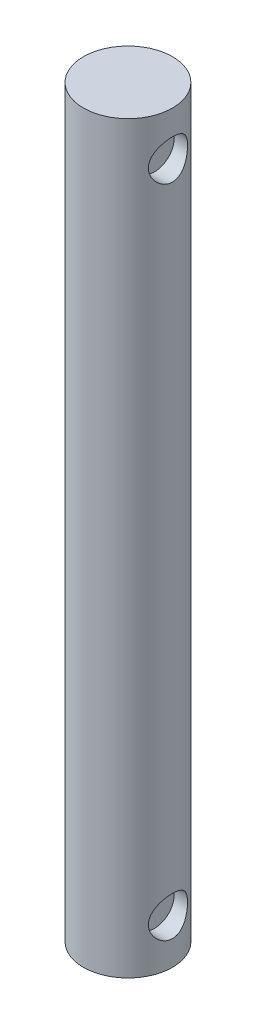
ISO-10303-21;
HEADER;
FILE_DESCRIPTION(('STEP AP214'),'2;1');
FILE_NAME('part.step','',(''),(''),'','','');
FILE_SCHEMA(('AUTOMOTIVE_DESIGN { 1 0 10303 214 1 1 1 1 }'));
ENDSEC;
DATA;
#1=APPLICATION_CONTEXT('core data for automotive mechanical design processes');
#2=APPLICATION_PROTOCOL_DEFINITION('international standard','automotive_design',2000,#1);
#3=PRODUCT_CONTEXT('',#1,'mechanical');
#4=PRODUCT('Part','Part','',(#3));
#5=PRODUCT_RELATED_PRODUCT_CATEGORY('part','',(#4));
#6=PRODUCT_DEFINITION_FORMATION('','',#4);
#7=PRODUCT_DEFINITION_CONTEXT('part definition',#1,'design');
#8=PRODUCT_DEFINITION('design','',#6,#7);
#9=PRODUCT_DEFINITION_SHAPE('','',#8);
#10=(LENGTH_UNIT() NAMED_UNIT(*) SI_UNIT(.MILLI.,.METRE.));
#11=(NAMED_UNIT(*) PLANE_ANGLE_UNIT() SI_UNIT($,.RADIAN.));
#12=(NAMED_UNIT(*) SI_UNIT($,.STERADIAN.) SOLID_ANGLE_UNIT());
#13=UNCERTAINTY_MEASURE_WITH_UNIT(LENGTH_MEASURE(1.E-05),#10,'distance_accuracy_value','');
#14=(GEOMETRIC_REPRESENTATION_CONTEXT(3) GLOBAL_UNCERTAINTY_ASSIGNED_CONTEXT((#13)) GLOBAL_UNIT_ASSIGNED_CONTEXT((#10,
#11,#12)) REPRESENTATION_CONTEXT('',''));
#15=CARTESIAN_POINT('',(0.,0.,0.));
#16=DIRECTION('',(0.,0.,1.));
#17=DIRECTION('',(1.,0.,0.));
#18=AXIS2_PLACEMENT_3D('',#15,#16,#17);
#19=CARTESIAN_POINT('',(0.,41.8,0.));
#20=DIRECTION('',(0.,-1.,0.));
#21=DIRECTION('',(0.,0.,-1.));
#22=AXIS2_PLACEMENT_3D('',#19,#20,#21);
#23=CYLINDRICAL_SURFACE('',#22,2.5);
#24=CARTESIAN_POINT('',(2.24499443206436,39.3,-1.1));
#25=CARTESIAN_POINT('',(2.24500186891575,39.241674654694,-1.09999264071967));
#26=CARTESIAN_POINT('',(2.2473008014463,39.183269043343,-1.09533182245849));
#27=CARTESIAN_POINT('',(2.2561976772502,39.0681643690612,-1.07687935781384));
#28=CARTESIAN_POINT('',(2.26280665090222,39.0114700763682,-1.06306428213531));
#29=CARTESIAN_POINT('',(2.27941479604708,38.9016706155969,-1.02696546928902));
#30=CARTESIAN_POINT('',(2.28939904371374,38.8485508614767,-1.00471896027897));
#31=CARTESIAN_POINT('',(2.31161149325762,38.7468109182473,-0.95249897480672));
#32=CARTESIAN_POINT('',(2.32383934302118,38.6981900248801,-0.922526710535584));
#33=CARTESIAN_POINT('',(2.35011094846473,38.6034189169875,-0.853478204326698));
#34=CARTESIAN_POINT('',(2.36422061386325,38.5576185897507,-0.813946593299063));
#35=CARTESIAN_POINT('',(2.39212743157456,38.4730354536982,-0.72785536218089));
#36=CARTESIAN_POINT('',(2.40592445299291,38.4342555383025,-0.681292858785612));
#37=CARTESIAN_POINT('',(2.43246847746696,38.3629552737527,-0.57964322792789));
#38=CARTESIAN_POINT('',(2.44513005272046,38.330838312376,-0.52424879689839));
#39=CARTESIAN_POINT('',(2.46715746778218,38.2765331018431,-0.408184216492109));
#40=CARTESIAN_POINT('',(2.47652493026685,38.2543399627552,-0.347516683060521));
#41=CARTESIAN_POINT('',(2.49043942220433,38.221810785617,-0.226310849545852));
#42=CARTESIAN_POINT('',(2.49523168581752,38.210868750425,-0.165963932126529));
#43=CARTESIAN_POINT('',(2.5003531145501,38.1991843333957,-0.0441134537254079));
#44=CARTESIAN_POINT('',(2.50068431305423,38.1984373046011,0.0173895674937711));
#45=CARTESIAN_POINT('',(2.49698346578356,38.2068682519153,0.135361763608578));
#46=CARTESIAN_POINT('',(2.49324539438955,38.2153774999111,0.191889766863553));
#47=CARTESIAN_POINT('',(2.48224055592851,38.2409199923936,0.302619645234436));
#48=CARTESIAN_POINT('',(2.47497352765724,38.257953867854,0.356821347840328));
#49=CARTESIAN_POINT('',(2.4574634692465,38.3002491841481,0.462364843718377));
#50=CARTESIAN_POINT('',(2.44717667746158,38.3256323232474,0.513650307195605));
#51=CARTESIAN_POINT('',(2.42461273867786,38.3837772625072,0.611368753826879));
#52=CARTESIAN_POINT('',(2.41233486895002,38.4165417436624,0.657799964862737));
#53=CARTESIAN_POINT('',(2.3858801337429,38.4914553253352,0.748309969403557));
#54=CARTESIAN_POINT('',(2.37162983972768,38.5341340628296,0.791929518202135));
#55=CARTESIAN_POINT('',(2.34352160386143,38.6261947482498,0.871604932828494));
#56=CARTESIAN_POINT('',(2.32966385255521,38.6755798863658,0.907657178035836));
#57=CARTESIAN_POINT('',(2.30334986356432,38.7821330266224,0.97255186396096));
#58=CARTESIAN_POINT('',(2.29097226218579,38.8395339410661,1.00104660738835));
#59=CARTESIAN_POINT('',(2.2699857105531,38.9590063630028,1.0477731426051));
#60=CARTESIAN_POINT('',(2.26137370960231,39.0210740417629,1.06601324561569));
#61=CARTESIAN_POINT('',(2.24967637482319,39.1435036430911,1.09047181528063));
#62=CARTESIAN_POINT('',(2.24624709890656,39.2036820078948,1.09744082962861));
#63=CARTESIAN_POINT('',(2.24431716581293,39.3244332185891,1.10138444364863));
#64=CARTESIAN_POINT('',(2.24581444755476,39.3850058889349,1.09836322284601));
#65=CARTESIAN_POINT('',(2.2532104139799,39.5000255489189,1.08309883991271));
#66=CARTESIAN_POINT('',(2.25877064140546,39.55459128823,1.07156417098469));
#67=CARTESIAN_POINT('',(2.27321525169579,39.6609541073331,1.04056836908943));
#68=CARTESIAN_POINT('',(2.28210047369949,39.7127504844382,1.0211052350816));
#69=CARTESIAN_POINT('',(2.30267121517148,39.814684975894,0.973855802064504));
#70=CARTESIAN_POINT('',(2.31446359544008,39.8646472184928,0.945738180525621));
#71=CARTESIAN_POINT('',(2.33938364186295,39.9594010288767,0.882295159103683));
#72=CARTESIAN_POINT('',(2.35251192744771,40.0041901772703,0.846966407868074));
#73=CARTESIAN_POINT('',(2.38009237517463,40.0916565167306,0.766250940130199));
#74=CARTESIAN_POINT('',(2.39455440317886,40.1337526461583,0.720235306799722));
#75=CARTESIAN_POINT('',(2.42206311373892,40.2097508108222,0.621478409089602));
#76=CARTESIAN_POINT('',(2.43510961335855,40.2436517876493,0.568736277320663));
#77=CARTESIAN_POINT('',(2.45847705567111,40.3024187536364,0.457328840448402));
#78=CARTESIAN_POINT('',(2.46877691176735,40.327215364046,0.398622234619686));
#79=CARTESIAN_POINT('',(2.48532596548122,40.3663785107195,0.277295435121201));
#80=CARTESIAN_POINT('',(2.49157788201844,40.3807520487317,0.214677899404991));
#81=CARTESIAN_POINT('',(2.49898163891922,40.3977072622065,0.0924681222925637));
#82=CARTESIAN_POINT('',(2.50048642500148,40.4011054568595,0.033009916445092));
#83=CARTESIAN_POINT('',(2.49923675127029,40.3982653256628,-0.0856232403929734));
#84=CARTESIAN_POINT('',(2.49648319991867,40.3920290552031,-0.144798249098671));
#85=CARTESIAN_POINT('',(2.48722160837499,40.3706808208866,-0.258552884051371));
#86=CARTESIAN_POINT('',(2.48087956206805,40.3559607682473,-0.313220762920484));
#87=CARTESIAN_POINT('',(2.46517470655145,40.3185157507052,-0.419273041124577));
#88=CARTESIAN_POINT('',(2.45581135994377,40.2957893616509,-0.470656854374066));
#89=CARTESIAN_POINT('',(2.43441956507932,40.2418276473412,-0.57128697644105));
#90=CARTESIAN_POINT('',(2.42228866159088,40.2102501618812,-0.620327472114026));
#91=CARTESIAN_POINT('',(2.39675984874361,40.1399579811249,-0.712628438098104));
#92=CARTESIAN_POINT('',(2.38336141336083,40.1012403162802,-0.755886490574638));
#93=CARTESIAN_POINT('',(2.35549351893128,40.01426463716,-0.838875102840794));
#94=CARTESIAN_POINT('',(2.34102108586691,39.9655013732494,-0.878076999318056));
#95=CARTESIAN_POINT('',(2.31365292914796,39.8616865342867,-0.947850118274257));
#96=CARTESIAN_POINT('',(2.30075817194161,39.8066311443604,-0.97841606542693));
#97=CARTESIAN_POINT('',(2.27815955688964,39.6914153856227,-1.02994457246076));
#98=CARTESIAN_POINT('',(2.26846264199146,39.6312442612513,-1.05088627507499));
#99=CARTESIAN_POINT('',(2.25376370647696,39.5077653762314,-1.08206209910023));
#100=CARTESIAN_POINT('',(2.24874593942601,39.4444688960103,-1.09233214658097));
#101=CARTESIAN_POINT('',(2.24547707915797,39.3538983672736,-1.09901270586322));
#102=CARTESIAN_POINT('',(2.24499099477939,39.3269577570695,-1.10000340143192));
#103=CARTESIAN_POINT('',(2.24499443206436,39.3,-1.1));
#104=B_SPLINE_CURVE_WITH_KNOTS('',3,(#24,#25,#26,#27,#28,#29,#30,#31,#32,#33,#34,#35,#36,#37,
#38,#39,#40,#41,#42,#43,#44,#45,#46,#47,#48,#49,#50,#51,#52,#53,#54,#55,#56,#57,#58,#59,#60,#61,
#62,#63,#64,#65,#66,#67,#68,#69,#70,#71,#72,#73,#74,#75,#76,#77,#78,#79,#80,#81,#82,#83,#84,#85,
#86,#87,#88,#89,#90,#91,#92,#93,#94,#95,#96,#97,#98,#99,#100,#101,#102,#103),.UNSPECIFIED.,.T.,
.F.,(4,2,2,2,2,2,2,2,2,2,2,2,2,2,2,2,2,2,2,2,2,2,2,2,2,2,2,2,2,2,2,2,2,2,2,2,2,2,2,4),(0.,
0.174891994667562,0.350233343674115,0.524809343440098,0.699357968434034,0.884928681651835,
1.07057570344714,1.26538500767086,1.46009821416858,1.64366581372381,1.82714973904772,
1.99820752306006,2.16927797025682,2.34296144404575,2.51670810381826,2.70388470367641,
2.89115065615066,3.08593731227327,3.28056586850661,3.46160310705006,3.64256461624718,
3.80995675730999,3.97739117215505,4.15226330196229,4.32721688891381,4.51839534153398,
4.70959847179733,4.90222980302484,5.09473161306756,5.27253594053547,5.45030234095708,
5.62044885932698,5.79062565831862,5.96859980397143,6.14664813538063,6.33841613542974,
6.53030102619199,6.72259982346399,6.91424912960409,6.99508355726003),.UNSPECIFIED.);
#105=CARTESIAN_POINT('',(2.24499443206436,39.3,-1.1));
#106=VERTEX_POINT('',#105);
#107=EDGE_CURVE('E10',#106,#106,#104,.T.);
#108=ORIENTED_EDGE('',*,*,#107,.T.);
#109=EDGE_LOOP('',(#108));
#110=FACE_BOUND('',#109,.T.);
#111=CARTESIAN_POINT('',(2.24499443206436,2.5,-1.1));
#112=CARTESIAN_POINT('',(2.24500186891575,2.44167465469401,-1.09999264071967));
#113=CARTESIAN_POINT('',(2.2473008014463,2.38326904334297,-1.09533182245849));
#114=CARTESIAN_POINT('',(2.2561976772502,2.2681643690612,-1.07687935781384));
#115=CARTESIAN_POINT('',(2.26280665090222,2.2114700763682,-1.06306428213531));
#116=CARTESIAN_POINT('',(2.27941479604708,2.10167061559693,-1.02696546928901));
#117=CARTESIAN_POINT('',(2.28939904371374,2.04855086147673,-1.00471896027897));
#118=CARTESIAN_POINT('',(2.31161149325762,1.94681091824731,-0.952498974806719));
#119=CARTESIAN_POINT('',(2.32383934302118,1.89819002488008,-0.922526710535581));
#120=CARTESIAN_POINT('',(2.35011094846474,1.80341891698745,-0.853478204326693));
#121=CARTESIAN_POINT('',(2.36422061386325,1.75761858975068,-0.813946593299058));
#122=CARTESIAN_POINT('',(2.39212743157456,1.67303545369821,-0.727855362180885));
#123=CARTESIAN_POINT('',(2.40592445299291,1.63425553830252,-0.681292858785606));
#124=CARTESIAN_POINT('',(2.43246847746696,1.56295527375275,-0.579643227927883));
#125=CARTESIAN_POINT('',(2.44513005272046,1.53083831237604,-0.524248796898383));
#126=CARTESIAN_POINT('',(2.46715746778218,1.47653310184309,-0.408184216492102));
#127=CARTESIAN_POINT('',(2.47652493026685,1.45433996275516,-0.347516683060515));
#128=CARTESIAN_POINT('',(2.49043942220433,1.42181078561702,-0.226310849545847));
#129=CARTESIAN_POINT('',(2.49523168581752,1.41086875042496,-0.165963932126523));
#130=CARTESIAN_POINT('',(2.5003531145501,1.39918433339569,-0.0441134537254018));
#131=CARTESIAN_POINT('',(2.50068431305423,1.39843730460108,0.0173895674937773));
#132=CARTESIAN_POINT('',(2.49698346578356,1.40686825191526,0.135361763608585));
#133=CARTESIAN_POINT('',(2.49324539438955,1.4153774999111,0.19188976686356));
#134=CARTESIAN_POINT('',(2.48224055592851,1.44091999239362,0.302619645234443));
#135=CARTESIAN_POINT('',(2.47497352765724,1.45795386785399,0.356821347840334));
#136=CARTESIAN_POINT('',(2.4574634692465,1.50024918414813,0.462364843718384));
#137=CARTESIAN_POINT('',(2.44717667746158,1.52563232324742,0.513650307195614));
#138=CARTESIAN_POINT('',(2.42461273867785,1.58377726250722,0.611368753826888));
#139=CARTESIAN_POINT('',(2.41233486895002,1.61654174366243,0.657799964862744));
#140=CARTESIAN_POINT('',(2.3858801337429,1.69145532533517,0.748309969403562));
#141=CARTESIAN_POINT('',(2.37162983972768,1.7341340628296,0.791929518202138));
#142=CARTESIAN_POINT('',(2.34352160386143,1.82619474824983,0.871604932828497));
#143=CARTESIAN_POINT('',(2.32966385255521,1.87557988636583,0.907657178035841));
#144=CARTESIAN_POINT('',(2.30334986356432,1.98213302662239,0.972551863960967));
#145=CARTESIAN_POINT('',(2.29097226218579,2.0395339410661,1.00104660738835));
#146=CARTESIAN_POINT('',(2.2699857105531,2.15900636300285,1.0477731426051));
#147=CARTESIAN_POINT('',(2.26137370960231,2.22107404176291,1.06601324561569));
#148=CARTESIAN_POINT('',(2.24967637482318,2.34350364309116,1.09047181528063));
#149=CARTESIAN_POINT('',(2.24624709890656,2.40368200789485,1.09744082962861));
#150=CARTESIAN_POINT('',(2.24431716581293,2.52443321858909,1.10138444364863));
#151=CARTESIAN_POINT('',(2.24581444755476,2.5850058889349,1.09836322284601));
#152=CARTESIAN_POINT('',(2.2532104139799,2.70002554891896,1.08309883991271));
#153=CARTESIAN_POINT('',(2.25877064140546,2.75459128823004,1.07156417098469));
#154=CARTESIAN_POINT('',(2.27321525169579,2.86095410733308,1.04056836908943));
#155=CARTESIAN_POINT('',(2.28210047369949,2.91275048443822,1.02110523508159));
#156=CARTESIAN_POINT('',(2.30267121517148,3.01468497589402,0.973855802064504));
#157=CARTESIAN_POINT('',(2.31446359544008,3.06464721849285,0.945738180525619));
#158=CARTESIAN_POINT('',(2.33938364186295,3.15940102887674,0.88229515910368));
#159=CARTESIAN_POINT('',(2.35251192744771,3.20419017727027,0.846966407868071));
#160=CARTESIAN_POINT('',(2.38009237517463,3.29165651673063,0.766250940130195));
#161=CARTESIAN_POINT('',(2.39455440317886,3.33375264615827,0.720235306799715));
#162=CARTESIAN_POINT('',(2.42206311373892,3.40975081082219,0.621478409089595));
#163=CARTESIAN_POINT('',(2.43510961335855,3.4436517876493,0.568736277320657));
#164=CARTESIAN_POINT('',(2.45847705567111,3.5024187536364,0.457328840448397));
#165=CARTESIAN_POINT('',(2.46877691176735,3.527215364046,0.398622234619679));
#166=CARTESIAN_POINT('',(2.48532596548122,3.56637851071951,0.277295435121193));
#167=CARTESIAN_POINT('',(2.49157788201844,3.58075204873171,0.214677899404983));
#168=CARTESIAN_POINT('',(2.49898163891922,3.59770726220648,0.092468122292555));
#169=CARTESIAN_POINT('',(2.50048642500148,3.60110545685954,0.0330099164450841));
#170=CARTESIAN_POINT('',(2.49923675127029,3.59826532566277,-0.08562324039298));
#171=CARTESIAN_POINT('',(2.49648319991867,3.5920290552031,-0.144798249098677));
#172=CARTESIAN_POINT('',(2.48722160837499,3.57068082088656,-0.258552884051375));
#173=CARTESIAN_POINT('',(2.48087956206805,3.5559607682473,-0.313220762920487));
#174=CARTESIAN_POINT('',(2.46517470655145,3.51851575070516,-0.41927304112458));
#175=CARTESIAN_POINT('',(2.45581135994377,3.49578936165091,-0.47065685437407));
#176=CARTESIAN_POINT('',(2.43441956507932,3.4418276473412,-0.571286976441056));
#177=CARTESIAN_POINT('',(2.42228866159088,3.41025016188116,-0.620327472114032));
#178=CARTESIAN_POINT('',(2.39675984874361,3.33995798112485,-0.712628438098109));
#179=CARTESIAN_POINT('',(2.38336141336083,3.30124031628022,-0.755886490574643));
#180=CARTESIAN_POINT('',(2.35549351893128,3.21426463716,-0.838875102840799));
#181=CARTESIAN_POINT('',(2.34102108586691,3.16550137324944,-0.878076999318062));
#182=CARTESIAN_POINT('',(2.31365292914796,3.06168653428675,-0.947850118274262));
#183=CARTESIAN_POINT('',(2.30075817194161,3.00663114436039,-0.978416065426935));
#184=CARTESIAN_POINT('',(2.27815955688964,2.89141538562266,-1.02994457246076));
#185=CARTESIAN_POINT('',(2.26846264199146,2.83124426125128,-1.05088627507499));
#186=CARTESIAN_POINT('',(2.25376370647696,2.70776537623142,-1.08206209910023));
#187=CARTESIAN_POINT('',(2.24874593942601,2.64446889601027,-1.09233214658097));
#188=CARTESIAN_POINT('',(2.24547707915797,2.55389836727359,-1.09901270586322));
#189=CARTESIAN_POINT('',(2.24499099477939,2.52695775706948,-1.10000340143192));
#190=CARTESIAN_POINT('',(2.24499443206436,2.5,-1.1));
#191=B_SPLINE_CURVE_WITH_KNOTS('',3,(#111,#112,#113,#114,#115,#116,#117,#118,#119,#120,#121,
#122,#123,#124,#125,#126,#127,#128,#129,#130,#131,#132,#133,#134,#135,#136,#137,#138,#139,#140,
#141,#142,#143,#144,#145,#146,#147,#148,#149,#150,#151,#152,#153,#154,#155,#156,#157,#158,#159,
#160,#161,#162,#163,#164,#165,#166,#167,#168,#169,#170,#171,#172,#173,#174,#175,#176,#177,#178,
#179,#180,#181,#182,#183,#184,#185,#186,#187,#188,#189,#190),.UNSPECIFIED.,.T.,.F.,(4,2,2,2,2,2,
2,2,2,2,2,2,2,2,2,2,2,2,2,2,2,2,2,2,2,2,2,2,2,2,2,2,2,2,2,2,2,2,2,4),(0.,0.174891994667566,
0.35023334367412,0.524809343440102,0.699357968434042,0.884928681651846,1.07057570344715,
1.26538500767087,1.46009821416859,1.64366581372382,1.82714973904773,1.99820752306006,
2.16927797025682,2.34296144404577,2.51670810381827,2.70388470367642,2.89115065615067,
3.08593731227328,3.28056586850662,3.46160310705007,3.64256461624719,3.80995675731,
3.97739117215506,4.1522633019623,4.32721688891383,4.51839534153399,4.70959847179734,
4.90222980302486,5.09473161306757,5.27253594053548,5.45030234095709,5.62044885932699,
5.79062565831863,5.96859980397145,6.14664813538065,6.33841613542975,6.530301026192,
6.722599823464,6.91424912960411,6.99508355726004),.UNSPECIFIED.);
#192=CARTESIAN_POINT('',(2.24499443206436,2.5,-1.1));
#193=VERTEX_POINT('',#192);
#194=EDGE_CURVE('E45',#193,#193,#191,.T.);
#195=ORIENTED_EDGE('',*,*,#194,.T.);
#196=EDGE_LOOP('',(#195));
#197=FACE_BOUND('',#196,.T.);
#198=CARTESIAN_POINT('',(0.,41.8,0.));
#199=DIRECTION('',(0.,1.,0.));
#200=DIRECTION('',(0.,0.,1.));
#201=AXIS2_PLACEMENT_3D('',#198,#199,#200);
#202=CIRCLE('',#201,2.5);
#203=CARTESIAN_POINT('',(0.,41.8,2.5));
#204=VERTEX_POINT('',#203);
#205=EDGE_CURVE('E49',#204,#204,#202,.T.);
#206=ORIENTED_EDGE('',*,*,#205,.F.);
#207=EDGE_LOOP('',(#206));
#208=FACE_BOUND('',#207,.T.);
#209=CARTESIAN_POINT('',(0.,0.,0.));
#210=DIRECTION('',(0.,1.,0.));
#211=DIRECTION('',(0.,0.,1.));
#212=AXIS2_PLACEMENT_3D('',#209,#210,#211);
#213=CIRCLE('',#212,2.5);
#214=CARTESIAN_POINT('',(0.,0.,2.5));
#215=VERTEX_POINT('',#214);
#216=EDGE_CURVE('E53',#215,#215,#213,.T.);
#217=ORIENTED_EDGE('',*,*,#216,.T.);
#218=EDGE_LOOP('',(#217));
#219=FACE_BOUND('',#218,.T.);
#220=ADVANCED_FACE('F34',(#110,#197,#208,#219),#23,.T.);
#221=CARTESIAN_POINT('',(0.,41.8,0.));
#222=DIRECTION('',(0.,1.,0.));
#223=DIRECTION('',(0.,0.,1.));
#224=AXIS2_PLACEMENT_3D('',#221,#222,#223);
#225=PLANE('',#224);
#226=ORIENTED_EDGE('',*,*,#205,.T.);
#227=EDGE_LOOP('',(#226));
#228=FACE_BOUND('',#227,.T.);
#229=ADVANCED_FACE('F68',(#228),#225,.T.);
#230=CARTESIAN_POINT('',(0.,0.,0.));
#231=DIRECTION('',(0.,1.,0.));
#232=DIRECTION('',(0.,0.,1.));
#233=AXIS2_PLACEMENT_3D('',#230,#231,#232);
#234=PLANE('',#233);
#235=ORIENTED_EDGE('',*,*,#216,.F.);
#236=EDGE_LOOP('',(#235));
#237=FACE_BOUND('',#236,.T.);
#238=ADVANCED_FACE('F66',(#237),#234,.F.);
#239=CARTESIAN_POINT('',(1.5,2.5,0.));
#240=DIRECTION('',(1.,0.,0.));
#241=DIRECTION('',(0.,0.,-1.));
#242=AXIS2_PLACEMENT_3D('',#239,#240,#241);
#243=CYLINDRICAL_SURFACE('',#242,1.1);
#244=CARTESIAN_POINT('',(1.5,2.5,0.));
#245=DIRECTION('',(1.,0.,0.));
#246=DIRECTION('',(0.,0.,-1.));
#247=AXIS2_PLACEMENT_3D('',#244,#245,#246);
#248=CIRCLE('',#247,1.1);
#249=CARTESIAN_POINT('',(1.5,2.5,-1.1));
#250=VERTEX_POINT('',#249);
#251=EDGE_CURVE('E85',#250,#250,#248,.T.);
#252=ORIENTED_EDGE('',*,*,#251,.F.);
#253=EDGE_LOOP('',(#252));
#254=FACE_BOUND('',#253,.T.);
#255=ORIENTED_EDGE('',*,*,#194,.F.);
#256=EDGE_LOOP('',(#255));
#257=FACE_BOUND('',#256,.T.);
#258=ADVANCED_FACE('F60',(#254,#257),#243,.F.);
#259=CARTESIAN_POINT('',(1.5,2.5,0.));
#260=DIRECTION('',(1.,0.,0.));
#261=DIRECTION('',(0.,0.,-1.));
#262=AXIS2_PLACEMENT_3D('',#259,#260,#261);
#263=PLANE('',#262);
#264=ORIENTED_EDGE('',*,*,#251,.T.);
#265=EDGE_LOOP('',(#264));
#266=FACE_BOUND('',#265,.T.);
#267=ADVANCED_FACE('F65',(#266),#263,.T.);
#268=CARTESIAN_POINT('',(1.5,39.3,0.));
#269=DIRECTION('',(1.,0.,0.));
#270=DIRECTION('',(0.,0.,-1.));
#271=AXIS2_PLACEMENT_3D('',#268,#269,#270);
#272=CYLINDRICAL_SURFACE('',#271,1.1);
#273=CARTESIAN_POINT('',(1.5,39.3,0.));
#274=DIRECTION('',(1.,0.,0.));
#275=DIRECTION('',(0.,0.,-1.));
#276=AXIS2_PLACEMENT_3D('',#273,#274,#275);
#277=CIRCLE('',#276,1.1);
#278=CARTESIAN_POINT('',(1.5,39.3,-1.1));
#279=VERTEX_POINT('',#278);
#280=EDGE_CURVE('E83',#279,#279,#277,.T.);
#281=ORIENTED_EDGE('',*,*,#280,.F.);
#282=EDGE_LOOP('',(#281));
#283=FACE_BOUND('',#282,.T.);
#284=ORIENTED_EDGE('',*,*,#107,.F.);
#285=EDGE_LOOP('',(#284));
#286=FACE_BOUND('',#285,.T.);
#287=ADVANCED_FACE('F95',(#283,#286),#272,.F.);
#288=CARTESIAN_POINT('',(1.5,39.3,0.));
#289=DIRECTION('',(1.,0.,0.));
#290=DIRECTION('',(0.,0.,-1.));
#291=AXIS2_PLACEMENT_3D('',#288,#289,#290);
#292=PLANE('',#291);
#293=ORIENTED_EDGE('',*,*,#280,.T.);
#294=EDGE_LOOP('',(#293));
#295=FACE_BOUND('',#294,.T.);
#296=ADVANCED_FACE('F99',(#295),#292,.T.);
#297=CLOSED_SHELL('',(#220,#229,#238,#258,#267,#287,#296));
#298=MANIFOLD_SOLID_BREP('B2',#297);
#299=ADVANCED_BREP_SHAPE_REPRESENTATION('',(#18,#298),#14);
#300=SHAPE_DEFINITION_REPRESENTATION(#9,#299);
ENDSEC;
END-ISO-10303-21;
